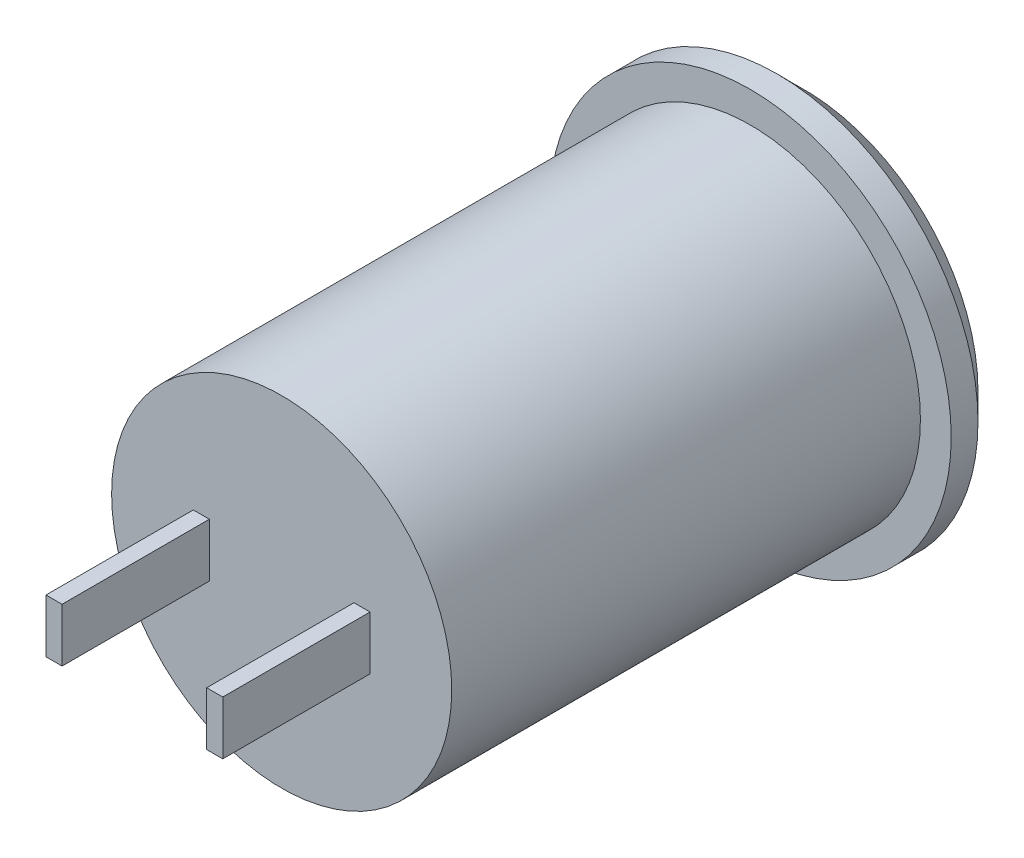
ISO-10303-21;
HEADER;
FILE_DESCRIPTION(('STEP AP214'),'2;1');
FILE_NAME('part.step','',(''),(''),'','','');
FILE_SCHEMA(('AUTOMOTIVE_DESIGN { 1 0 10303 214 1 1 1 1 }'));
ENDSEC;
DATA;
#1=APPLICATION_CONTEXT('core data for automotive mechanical design processes');
#2=APPLICATION_PROTOCOL_DEFINITION('international standard','automotive_design',2000,#1);
#3=PRODUCT_CONTEXT('',#1,'mechanical');
#4=PRODUCT('Part','Part','',(#3));
#5=PRODUCT_RELATED_PRODUCT_CATEGORY('part','',(#4));
#6=PRODUCT_DEFINITION_FORMATION('','',#4);
#7=PRODUCT_DEFINITION_CONTEXT('part definition',#1,'design');
#8=PRODUCT_DEFINITION('design','',#6,#7);
#9=PRODUCT_DEFINITION_SHAPE('','',#8);
#10=(LENGTH_UNIT() NAMED_UNIT(*) SI_UNIT(.MILLI.,.METRE.));
#11=(NAMED_UNIT(*) PLANE_ANGLE_UNIT() SI_UNIT($,.RADIAN.));
#12=(NAMED_UNIT(*) SI_UNIT($,.STERADIAN.) SOLID_ANGLE_UNIT());
#13=UNCERTAINTY_MEASURE_WITH_UNIT(LENGTH_MEASURE(1.E-05),#10,'distance_accuracy_value','');
#14=(GEOMETRIC_REPRESENTATION_CONTEXT(3) GLOBAL_UNCERTAINTY_ASSIGNED_CONTEXT((#13)) GLOBAL_UNIT_ASSIGNED_CONTEXT((#10,
#11,#12)) REPRESENTATION_CONTEXT('',''));
#15=CARTESIAN_POINT('',(0.,0.,0.));
#16=DIRECTION('',(0.,0.,1.));
#17=DIRECTION('',(1.,0.,0.));
#18=AXIS2_PLACEMENT_3D('',#15,#16,#17);
#19=CARTESIAN_POINT('',(0.,0.,0.));
#20=DIRECTION('',(0.,0.,-1.));
#21=DIRECTION('',(-1.,0.,0.));
#22=AXIS2_PLACEMENT_3D('',#19,#20,#21);
#23=PLANE('',#22);
#24=DIRECTION('',(1.,0.,0.));
#25=VECTOR('',#24,1.);
#26=CARTESIAN_POINT('',(3.3,1.,0.));
#27=LINE('',#26,#25);
#28=CARTESIAN_POINT('',(2.7,1.,0.));
#29=VERTEX_POINT('',#28);
#30=CARTESIAN_POINT('',(3.3,1.,0.));
#31=VERTEX_POINT('',#30);
#32=EDGE_CURVE('E132',#29,#31,#27,.T.);
#33=ORIENTED_EDGE('',*,*,#32,.T.);
#34=DIRECTION('',(0.,-1.,0.));
#35=VECTOR('',#34,1.);
#36=CARTESIAN_POINT('',(3.3,1.,0.));
#37=LINE('',#36,#35);
#38=CARTESIAN_POINT('',(3.3,-1.,0.));
#39=VERTEX_POINT('',#38);
#40=EDGE_CURVE('E106',#31,#39,#37,.T.);
#41=ORIENTED_EDGE('',*,*,#40,.T.);
#42=DIRECTION('',(-1.,0.,0.));
#43=VECTOR('',#42,1.);
#44=CARTESIAN_POINT('',(3.3,-1.,0.));
#45=LINE('',#44,#43);
#46=CARTESIAN_POINT('',(2.7,-1.,0.));
#47=VERTEX_POINT('',#46);
#48=EDGE_CURVE('E122',#39,#47,#45,.T.);
#49=ORIENTED_EDGE('',*,*,#48,.T.);
#50=DIRECTION('',(0.,1.,0.));
#51=VECTOR('',#50,1.);
#52=CARTESIAN_POINT('',(2.7,1.,0.));
#53=LINE('',#52,#51);
#54=EDGE_CURVE('E47',#47,#29,#53,.T.);
#55=ORIENTED_EDGE('',*,*,#54,.T.);
#56=EDGE_LOOP('',(#33,#41,#49,#55));
#57=FACE_BOUND('',#56,.T.);
#58=CARTESIAN_POINT('',(0.,0.,0.));
#59=DIRECTION('',(0.,0.,-1.));
#60=DIRECTION('',(-1.,0.,0.));
#61=AXIS2_PLACEMENT_3D('',#58,#59,#60);
#62=CIRCLE('',#61,6.35);
#63=CARTESIAN_POINT('',(-6.35,0.,0.));
#64=VERTEX_POINT('',#63);
#65=EDGE_CURVE('E11',#64,#64,#62,.T.);
#66=ORIENTED_EDGE('',*,*,#65,.F.);
#67=EDGE_LOOP('',(#66));
#68=FACE_BOUND('',#67,.T.);
#69=DIRECTION('',(0.,-1.,0.));
#70=VECTOR('',#69,1.);
#71=CARTESIAN_POINT('',(-3.3,1.,0.));
#72=LINE('',#71,#70);
#73=CARTESIAN_POINT('',(-3.3,1.,0.));
#74=VERTEX_POINT('',#73);
#75=CARTESIAN_POINT('',(-3.3,-1.,0.));
#76=VERTEX_POINT('',#75);
#77=EDGE_CURVE('E111',#74,#76,#72,.T.);
#78=ORIENTED_EDGE('',*,*,#77,.F.);
#79=DIRECTION('',(-1.,0.,0.));
#80=VECTOR('',#79,1.);
#81=CARTESIAN_POINT('',(-3.3,1.,0.));
#82=LINE('',#81,#80);
#83=CARTESIAN_POINT('',(-2.7,1.,0.));
#84=VERTEX_POINT('',#83);
#85=EDGE_CURVE('E145',#84,#74,#82,.T.);
#86=ORIENTED_EDGE('',*,*,#85,.F.);
#87=DIRECTION('',(0.,1.,0.));
#88=VECTOR('',#87,1.);
#89=CARTESIAN_POINT('',(-2.7,1.,0.));
#90=LINE('',#89,#88);
#91=CARTESIAN_POINT('',(-2.7,-1.,0.));
#92=VERTEX_POINT('',#91);
#93=EDGE_CURVE('E155',#92,#84,#90,.T.);
#94=ORIENTED_EDGE('',*,*,#93,.F.);
#95=DIRECTION('',(1.,0.,0.));
#96=VECTOR('',#95,1.);
#97=CARTESIAN_POINT('',(-3.3,-1.,0.));
#98=LINE('',#97,#96);
#99=EDGE_CURVE('E55',#76,#92,#98,.T.);
#100=ORIENTED_EDGE('',*,*,#99,.F.);
#101=EDGE_LOOP('',(#78,#86,#94,#100));
#102=FACE_BOUND('',#101,.T.);
#103=ADVANCED_FACE('F33',(#57,#68,#102),#23,.F.);
#104=CARTESIAN_POINT('',(0.,0.,-19.5));
#105=DIRECTION('',(0.,0.,-1.));
#106=DIRECTION('',(-1.,0.,0.));
#107=AXIS2_PLACEMENT_3D('',#104,#105,#106);
#108=CYLINDRICAL_SURFACE('',#107,6.35);
#109=CARTESIAN_POINT('',(0.,0.,-17.5));
#110=DIRECTION('',(0.,0.,-1.));
#111=DIRECTION('',(-1.,0.,0.));
#112=AXIS2_PLACEMENT_3D('',#109,#110,#111);
#113=CIRCLE('',#112,6.35);
#114=CARTESIAN_POINT('',(-6.35,0.,-17.5));
#115=VERTEX_POINT('',#114);
#116=EDGE_CURVE('E40',#115,#115,#113,.T.);
#117=ORIENTED_EDGE('',*,*,#116,.F.);
#118=EDGE_LOOP('',(#117));
#119=FACE_BOUND('',#118,.T.);
#120=ORIENTED_EDGE('',*,*,#65,.T.);
#121=EDGE_LOOP('',(#120));
#122=FACE_BOUND('',#121,.T.);
#123=ADVANCED_FACE('F189',(#119,#122),#108,.T.);
#124=CARTESIAN_POINT('',(6.35,0.,-17.5));
#125=DIRECTION('',(0.,0.,-1.));
#126=DIRECTION('',(-1.,0.,0.));
#127=AXIS2_PLACEMENT_3D('',#124,#125,#126);
#128=PLANE('',#127);
#129=CARTESIAN_POINT('',(0.,0.,-17.5));
#130=DIRECTION('',(0.,0.,-1.));
#131=DIRECTION('',(-1.,0.,0.));
#132=AXIS2_PLACEMENT_3D('',#129,#130,#131);
#133=CIRCLE('',#132,7.5);
#134=CARTESIAN_POINT('',(-7.5,0.,-17.5));
#135=VERTEX_POINT('',#134);
#136=EDGE_CURVE('E182',#135,#135,#133,.T.);
#137=ORIENTED_EDGE('',*,*,#136,.F.);
#138=EDGE_LOOP('',(#137));
#139=FACE_BOUND('',#138,.T.);
#140=ORIENTED_EDGE('',*,*,#116,.T.);
#141=EDGE_LOOP('',(#140));
#142=FACE_BOUND('',#141,.T.);
#143=ADVANCED_FACE('F187',(#139,#142),#128,.F.);
#144=CARTESIAN_POINT('',(0.,0.,-19.5));
#145=DIRECTION('',(0.,0.,-1.));
#146=DIRECTION('',(-1.,0.,0.));
#147=AXIS2_PLACEMENT_3D('',#144,#145,#146);
#148=CYLINDRICAL_SURFACE('',#147,7.5);
#149=CARTESIAN_POINT('',(0.,0.,-18.5));
#150=DIRECTION('',(0.,0.,-1.));
#151=DIRECTION('',(-1.,0.,0.));
#152=AXIS2_PLACEMENT_3D('',#149,#150,#151);
#153=CIRCLE('',#152,7.5);
#154=CARTESIAN_POINT('',(-7.5,0.,-18.5));
#155=VERTEX_POINT('',#154);
#156=EDGE_CURVE('E179',#155,#155,#153,.T.);
#157=ORIENTED_EDGE('',*,*,#156,.F.);
#158=EDGE_LOOP('',(#157));
#159=FACE_BOUND('',#158,.T.);
#160=ORIENTED_EDGE('',*,*,#136,.T.);
#161=EDGE_LOOP('',(#160));
#162=FACE_BOUND('',#161,.T.);
#163=ADVANCED_FACE('F238',(#159,#162),#148,.T.);
#164=CARTESIAN_POINT('',(0.,0.,-18.5));
#165=DIRECTION('',(0.,0.,1.));
#166=DIRECTION('',(1.,0.,0.));
#167=AXIS2_PLACEMENT_3D('',#164,#165,#166);
#168=CONICAL_SURFACE('',#167,7.5,0.785398163397445);
#169=CARTESIAN_POINT('',(0.,0.,-19.5));
#170=DIRECTION('',(0.,0.,-1.));
#171=DIRECTION('',(-1.,0.,0.));
#172=AXIS2_PLACEMENT_3D('',#169,#170,#171);
#173=CIRCLE('',#172,6.50000000000001);
#174=CARTESIAN_POINT('',(-6.50000000000001,0.,-19.5));
#175=VERTEX_POINT('',#174);
#176=EDGE_CURVE('E176',#175,#175,#173,.T.);
#177=ORIENTED_EDGE('',*,*,#176,.F.);
#178=EDGE_LOOP('',(#177));
#179=FACE_BOUND('',#178,.T.);
#180=ORIENTED_EDGE('',*,*,#156,.T.);
#181=EDGE_LOOP('',(#180));
#182=FACE_BOUND('',#181,.T.);
#183=ADVANCED_FACE('F234',(#179,#182),#168,.T.);
#184=CARTESIAN_POINT('',(6.50000000000001,0.,-19.5));
#185=DIRECTION('',(0.,0.,1.));
#186=DIRECTION('',(1.,0.,0.));
#187=AXIS2_PLACEMENT_3D('',#184,#185,#186);
#188=PLANE('',#187);
#189=CARTESIAN_POINT('',(0.,0.,-19.5));
#190=DIRECTION('',(0.,0.,-1.));
#191=DIRECTION('',(-1.,0.,0.));
#192=AXIS2_PLACEMENT_3D('',#189,#190,#191);
#193=CIRCLE('',#192,4.76249999999999);
#194=CARTESIAN_POINT('',(-4.76249999999999,0.,-19.5));
#195=VERTEX_POINT('',#194);
#196=EDGE_CURVE('E170',#195,#195,#193,.T.);
#197=ORIENTED_EDGE('',*,*,#196,.F.);
#198=EDGE_LOOP('',(#197));
#199=FACE_BOUND('',#198,.T.);
#200=ORIENTED_EDGE('',*,*,#176,.T.);
#201=EDGE_LOOP('',(#200));
#202=FACE_BOUND('',#201,.T.);
#203=ADVANCED_FACE('F230',(#199,#202),#188,.F.);
#204=CARTESIAN_POINT('',(0.,0.,-13.500012));
#205=DIRECTION('',(0.,0.,-1.));
#206=DIRECTION('',(-1.,0.,0.));
#207=AXIS2_PLACEMENT_3D('',#204,#205,#206);
#208=CONICAL_SURFACE('',#207,4.7625,1.02974425867665);
#209=CARTESIAN_POINT('',(0.,0.,-10.6384133018812));
#210=VERTEX_POINT('',#209);
#211=VERTEX_LOOP('',#210);
#212=FACE_BOUND('',#211,.T.);
#213=CARTESIAN_POINT('',(0.,0.,-13.500012));
#214=DIRECTION('',(0.,0.,-1.));
#215=DIRECTION('',(-1.,0.,0.));
#216=AXIS2_PLACEMENT_3D('',#213,#214,#215);
#217=CIRCLE('',#216,4.7625);
#218=CARTESIAN_POINT('',(-4.7625,0.,-13.500012));
#219=VERTEX_POINT('',#218);
#220=EDGE_CURVE('E173',#219,#219,#217,.T.);
#221=ORIENTED_EDGE('',*,*,#220,.T.);
#222=EDGE_LOOP('',(#221));
#223=FACE_BOUND('',#222,.T.);
#224=ADVANCED_FACE('F226',(#212,#223),#208,.F.);
#225=CARTESIAN_POINT('',(0.,0.,-19.5));
#226=DIRECTION('',(0.,0.,-1.));
#227=DIRECTION('',(-1.,0.,0.));
#228=AXIS2_PLACEMENT_3D('',#225,#226,#227);
#229=CYLINDRICAL_SURFACE('',#228,4.76249999999999);
#230=ORIENTED_EDGE('',*,*,#220,.F.);
#231=EDGE_LOOP('',(#230));
#232=FACE_BOUND('',#231,.T.);
#233=ORIENTED_EDGE('',*,*,#196,.T.);
#234=EDGE_LOOP('',(#233));
#235=FACE_BOUND('',#234,.T.);
#236=ADVANCED_FACE('F220',(#232,#235),#229,.F.);
#237=CARTESIAN_POINT('',(-3.3,1.,5.5));
#238=DIRECTION('',(1.,0.,0.));
#239=DIRECTION('',(0.,1.,0.));
#240=AXIS2_PLACEMENT_3D('',#237,#238,#239);
#241=PLANE('',#240);
#242=ORIENTED_EDGE('',*,*,#77,.T.);
#243=DIRECTION('',(0.,0.,-1.));
#244=VECTOR('',#243,1.);
#245=CARTESIAN_POINT('',(-3.3,-1.,5.5));
#246=LINE('',#245,#244);
#247=CARTESIAN_POINT('',(-3.3,-1.,5.5));
#248=VERTEX_POINT('',#247);
#249=EDGE_CURVE('E168',#248,#76,#246,.T.);
#250=ORIENTED_EDGE('',*,*,#249,.F.);
#251=DIRECTION('',(0.,-1.,0.));
#252=VECTOR('',#251,1.);
#253=CARTESIAN_POINT('',(-3.3,1.,5.5));
#254=LINE('',#253,#252);
#255=CARTESIAN_POINT('',(-3.3,1.,5.5));
#256=VERTEX_POINT('',#255);
#257=EDGE_CURVE('E141',#256,#248,#254,.T.);
#258=ORIENTED_EDGE('',*,*,#257,.F.);
#259=DIRECTION('',(0.,0.,-1.));
#260=VECTOR('',#259,1.);
#261=CARTESIAN_POINT('',(-3.3,1.,5.5));
#262=LINE('',#261,#260);
#263=EDGE_CURVE('E151',#256,#74,#262,.T.);
#264=ORIENTED_EDGE('',*,*,#263,.T.);
#265=EDGE_LOOP('',(#242,#250,#258,#264));
#266=FACE_BOUND('',#265,.T.);
#267=ADVANCED_FACE('F204',(#266),#241,.F.);
#268=CARTESIAN_POINT('',(-3.3,-1.,5.5));
#269=DIRECTION('',(0.,1.,0.));
#270=DIRECTION('',(0.,0.,1.));
#271=AXIS2_PLACEMENT_3D('',#268,#269,#270);
#272=PLANE('',#271);
#273=ORIENTED_EDGE('',*,*,#99,.T.);
#274=DIRECTION('',(0.,0.,-1.));
#275=VECTOR('',#274,1.);
#276=CARTESIAN_POINT('',(-2.7,-1.,5.5));
#277=LINE('',#276,#275);
#278=CARTESIAN_POINT('',(-2.7,-1.,5.5));
#279=VERTEX_POINT('',#278);
#280=EDGE_CURVE('E165',#279,#92,#277,.T.);
#281=ORIENTED_EDGE('',*,*,#280,.F.);
#282=DIRECTION('',(1.,0.,0.));
#283=VECTOR('',#282,1.);
#284=CARTESIAN_POINT('',(-3.3,-1.,5.5));
#285=LINE('',#284,#283);
#286=EDGE_CURVE('E144',#248,#279,#285,.T.);
#287=ORIENTED_EDGE('',*,*,#286,.F.);
#288=ORIENTED_EDGE('',*,*,#249,.T.);
#289=EDGE_LOOP('',(#273,#281,#287,#288));
#290=FACE_BOUND('',#289,.T.);
#291=ADVANCED_FACE('F212',(#290),#272,.F.);
#292=CARTESIAN_POINT('',(-2.7,1.,5.5));
#293=DIRECTION('',(-1.,0.,0.));
#294=DIRECTION('',(0.,-1.,0.));
#295=AXIS2_PLACEMENT_3D('',#292,#293,#294);
#296=PLANE('',#295);
#297=ORIENTED_EDGE('',*,*,#93,.T.);
#298=DIRECTION('',(0.,0.,-1.));
#299=VECTOR('',#298,1.);
#300=CARTESIAN_POINT('',(-2.7,1.,5.5));
#301=LINE('',#300,#299);
#302=CARTESIAN_POINT('',(-2.7,1.,5.5));
#303=VERTEX_POINT('',#302);
#304=EDGE_CURVE('E162',#303,#84,#301,.T.);
#305=ORIENTED_EDGE('',*,*,#304,.F.);
#306=DIRECTION('',(0.,1.,0.));
#307=VECTOR('',#306,1.);
#308=CARTESIAN_POINT('',(-2.7,1.,5.5));
#309=LINE('',#308,#307);
#310=EDGE_CURVE('E147',#279,#303,#309,.T.);
#311=ORIENTED_EDGE('',*,*,#310,.F.);
#312=ORIENTED_EDGE('',*,*,#280,.T.);
#313=EDGE_LOOP('',(#297,#305,#311,#312));
#314=FACE_BOUND('',#313,.T.);
#315=ADVANCED_FACE('F210',(#314),#296,.F.);
#316=CARTESIAN_POINT('',(-3.3,1.,5.5));
#317=DIRECTION('',(0.,-1.,0.));
#318=DIRECTION('',(1.,0.,0.));
#319=AXIS2_PLACEMENT_3D('',#316,#317,#318);
#320=PLANE('',#319);
#321=ORIENTED_EDGE('',*,*,#85,.T.);
#322=ORIENTED_EDGE('',*,*,#263,.F.);
#323=DIRECTION('',(-1.,0.,0.));
#324=VECTOR('',#323,1.);
#325=CARTESIAN_POINT('',(-3.3,1.,5.5));
#326=LINE('',#325,#324);
#327=EDGE_CURVE('E149',#303,#256,#326,.T.);
#328=ORIENTED_EDGE('',*,*,#327,.F.);
#329=ORIENTED_EDGE('',*,*,#304,.T.);
#330=EDGE_LOOP('',(#321,#322,#328,#329));
#331=FACE_BOUND('',#330,.T.);
#332=ADVANCED_FACE('F200',(#331),#320,.F.);
#333=CARTESIAN_POINT('',(0.,0.,5.5));
#334=DIRECTION('',(0.,0.,1.));
#335=DIRECTION('',(1.,0.,0.));
#336=AXIS2_PLACEMENT_3D('',#333,#334,#335);
#337=PLANE('',#336);
#338=ORIENTED_EDGE('',*,*,#257,.T.);
#339=ORIENTED_EDGE('',*,*,#286,.T.);
#340=ORIENTED_EDGE('',*,*,#310,.T.);
#341=ORIENTED_EDGE('',*,*,#327,.T.);
#342=EDGE_LOOP('',(#338,#339,#340,#341));
#343=FACE_BOUND('',#342,.T.);
#344=ADVANCED_FACE('F206',(#343),#337,.T.);
#345=CARTESIAN_POINT('',(3.3,1.,5.5));
#346=DIRECTION('',(1.,0.,0.));
#347=DIRECTION('',(0.,1.,0.));
#348=AXIS2_PLACEMENT_3D('',#345,#346,#347);
#349=PLANE('',#348);
#350=ORIENTED_EDGE('',*,*,#40,.F.);
#351=DIRECTION('',(0.,0.,-1.));
#352=VECTOR('',#351,1.);
#353=CARTESIAN_POINT('',(3.3,1.,5.5));
#354=LINE('',#353,#352);
#355=CARTESIAN_POINT('',(3.3,1.,5.5));
#356=VERTEX_POINT('',#355);
#357=EDGE_CURVE('E100',#356,#31,#354,.T.);
#358=ORIENTED_EDGE('',*,*,#357,.F.);
#359=DIRECTION('',(0.,-1.,0.));
#360=VECTOR('',#359,1.);
#361=CARTESIAN_POINT('',(3.3,1.,5.5));
#362=LINE('',#361,#360);
#363=CARTESIAN_POINT('',(3.3,-1.,5.5));
#364=VERTEX_POINT('',#363);
#365=EDGE_CURVE('E103',#356,#364,#362,.T.);
#366=ORIENTED_EDGE('',*,*,#365,.T.);
#367=DIRECTION('',(0.,0.,-1.));
#368=VECTOR('',#367,1.);
#369=CARTESIAN_POINT('',(3.3,-1.,5.5));
#370=LINE('',#369,#368);
#371=EDGE_CURVE('E130',#364,#39,#370,.T.);
#372=ORIENTED_EDGE('',*,*,#371,.T.);
#373=EDGE_LOOP('',(#350,#358,#366,#372));
#374=FACE_BOUND('',#373,.T.);
#375=ADVANCED_FACE('F102',(#374),#349,.T.);
#376=CARTESIAN_POINT('',(3.3,1.,5.5));
#377=DIRECTION('',(0.,1.,0.));
#378=DIRECTION('',(-1.,0.,0.));
#379=AXIS2_PLACEMENT_3D('',#376,#377,#378);
#380=PLANE('',#379);
#381=ORIENTED_EDGE('',*,*,#32,.F.);
#382=DIRECTION('',(0.,0.,-1.));
#383=VECTOR('',#382,1.);
#384=CARTESIAN_POINT('',(2.7,1.,5.5));
#385=LINE('',#384,#383);
#386=CARTESIAN_POINT('',(2.7,1.,5.5));
#387=VERTEX_POINT('',#386);
#388=EDGE_CURVE('E112',#387,#29,#385,.T.);
#389=ORIENTED_EDGE('',*,*,#388,.F.);
#390=DIRECTION('',(1.,0.,0.));
#391=VECTOR('',#390,1.);
#392=CARTESIAN_POINT('',(3.3,1.,5.5));
#393=LINE('',#392,#391);
#394=EDGE_CURVE('E118',#387,#356,#393,.T.);
#395=ORIENTED_EDGE('',*,*,#394,.T.);
#396=ORIENTED_EDGE('',*,*,#357,.T.);
#397=EDGE_LOOP('',(#381,#389,#395,#396));
#398=FACE_BOUND('',#397,.T.);
#399=ADVANCED_FACE('F124',(#398),#380,.T.);
#400=CARTESIAN_POINT('',(2.7,1.,5.5));
#401=DIRECTION('',(-1.,0.,0.));
#402=DIRECTION('',(0.,-1.,0.));
#403=AXIS2_PLACEMENT_3D('',#400,#401,#402);
#404=PLANE('',#403);
#405=ORIENTED_EDGE('',*,*,#54,.F.);
#406=DIRECTION('',(0.,0.,-1.));
#407=VECTOR('',#406,1.);
#408=CARTESIAN_POINT('',(2.7,-1.,5.5));
#409=LINE('',#408,#407);
#410=CARTESIAN_POINT('',(2.7,-1.,5.5));
#411=VERTEX_POINT('',#410);
#412=EDGE_CURVE('E138',#411,#47,#409,.T.);
#413=ORIENTED_EDGE('',*,*,#412,.F.);
#414=DIRECTION('',(0.,1.,0.));
#415=VECTOR('',#414,1.);
#416=CARTESIAN_POINT('',(2.7,1.,5.5));
#417=LINE('',#416,#415);
#418=EDGE_CURVE('E125',#411,#387,#417,.T.);
#419=ORIENTED_EDGE('',*,*,#418,.T.);
#420=ORIENTED_EDGE('',*,*,#388,.T.);
#421=EDGE_LOOP('',(#405,#413,#419,#420));
#422=FACE_BOUND('',#421,.T.);
#423=ADVANCED_FACE('F323',(#422),#404,.T.);
#424=CARTESIAN_POINT('',(3.3,-1.,5.5));
#425=DIRECTION('',(0.,-1.,0.));
#426=DIRECTION('',(0.,0.,-1.));
#427=AXIS2_PLACEMENT_3D('',#424,#425,#426);
#428=PLANE('',#427);
#429=ORIENTED_EDGE('',*,*,#48,.F.);
#430=ORIENTED_EDGE('',*,*,#371,.F.);
#431=DIRECTION('',(-1.,0.,0.));
#432=VECTOR('',#431,1.);
#433=CARTESIAN_POINT('',(3.3,-1.,5.5));
#434=LINE('',#433,#432);
#435=EDGE_CURVE('E121',#364,#411,#434,.T.);
#436=ORIENTED_EDGE('',*,*,#435,.T.);
#437=ORIENTED_EDGE('',*,*,#412,.T.);
#438=EDGE_LOOP('',(#429,#430,#436,#437));
#439=FACE_BOUND('',#438,.T.);
#440=ADVANCED_FACE('F332',(#439),#428,.T.);
#441=CARTESIAN_POINT('',(0.,0.,5.5));
#442=DIRECTION('',(0.,0.,1.));
#443=DIRECTION('',(-1.,0.,0.));
#444=AXIS2_PLACEMENT_3D('',#441,#442,#443);
#445=PLANE('',#444);
#446=ORIENTED_EDGE('',*,*,#365,.F.);
#447=ORIENTED_EDGE('',*,*,#394,.F.);
#448=ORIENTED_EDGE('',*,*,#418,.F.);
#449=ORIENTED_EDGE('',*,*,#435,.F.);
#450=EDGE_LOOP('',(#446,#447,#448,#449));
#451=FACE_BOUND('',#450,.T.);
#452=ADVANCED_FACE('F116',(#451),#445,.T.);
#453=CLOSED_SHELL('',(#103,#123,#143,#163,#183,#203,#224,#236,#267,#291,#315,#332,#344,#375,
#399,#423,#440,#452));
#454=MANIFOLD_SOLID_BREP('B2',#453);
#455=ADVANCED_BREP_SHAPE_REPRESENTATION('',(#18,#454),#14);
#456=SHAPE_DEFINITION_REPRESENTATION(#9,#455);
ENDSEC;
END-ISO-10303-21;
